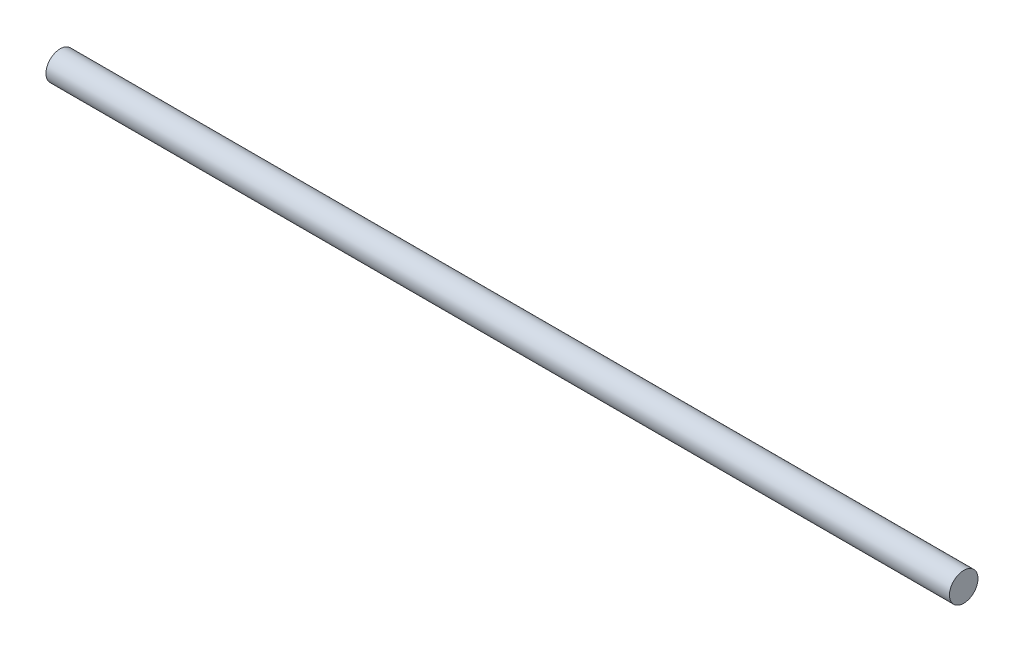
ISO-10303-21;
HEADER;
FILE_DESCRIPTION(('STEP AP214'),'2;1');
FILE_NAME('part.step','',(''),(''),'','','');
FILE_SCHEMA(('AUTOMOTIVE_DESIGN { 1 0 10303 214 1 1 1 1 }'));
ENDSEC;
DATA;
#1=APPLICATION_CONTEXT('core data for automotive mechanical design processes');
#2=APPLICATION_PROTOCOL_DEFINITION('international standard','automotive_design',2000,#1);
#3=PRODUCT_CONTEXT('',#1,'mechanical');
#4=PRODUCT('Part','Part','',(#3));
#5=PRODUCT_RELATED_PRODUCT_CATEGORY('part','',(#4));
#6=PRODUCT_DEFINITION_FORMATION('','',#4);
#7=PRODUCT_DEFINITION_CONTEXT('part definition',#1,'design');
#8=PRODUCT_DEFINITION('design','',#6,#7);
#9=PRODUCT_DEFINITION_SHAPE('','',#8);
#10=(LENGTH_UNIT() NAMED_UNIT(*) SI_UNIT(.MILLI.,.METRE.));
#11=(NAMED_UNIT(*) PLANE_ANGLE_UNIT() SI_UNIT($,.RADIAN.));
#12=(NAMED_UNIT(*) SI_UNIT($,.STERADIAN.) SOLID_ANGLE_UNIT());
#13=UNCERTAINTY_MEASURE_WITH_UNIT(LENGTH_MEASURE(1.E-05),#10,'distance_accuracy_value','');
#14=(GEOMETRIC_REPRESENTATION_CONTEXT(3) GLOBAL_UNCERTAINTY_ASSIGNED_CONTEXT((#13)) GLOBAL_UNIT_ASSIGNED_CONTEXT((#10,
#11,#12)) REPRESENTATION_CONTEXT('',''));
#15=CARTESIAN_POINT('',(0.,0.,0.));
#16=DIRECTION('',(0.,0.,1.));
#17=DIRECTION('',(1.,0.,0.));
#18=AXIS2_PLACEMENT_3D('',#15,#16,#17);
#19=CARTESIAN_POINT('',(190.,0.,0.));
#20=DIRECTION('',(-1.,0.,0.));
#21=DIRECTION('',(0.,0.,1.));
#22=AXIS2_PLACEMENT_3D('',#19,#20,#21);
#23=CYLINDRICAL_SURFACE('',#22,3.);
#24=CARTESIAN_POINT('',(190.,0.,0.));
#25=DIRECTION('',(1.,0.,0.));
#26=DIRECTION('',(0.,0.,-1.));
#27=AXIS2_PLACEMENT_3D('',#24,#25,#26);
#28=CIRCLE('',#27,3.);
#29=CARTESIAN_POINT('',(190.,0.,-3.));
#30=VERTEX_POINT('',#29);
#31=EDGE_CURVE('E10',#30,#30,#28,.T.);
#32=ORIENTED_EDGE('',*,*,#31,.F.);
#33=EDGE_LOOP('',(#32));
#34=FACE_BOUND('',#33,.T.);
#35=CARTESIAN_POINT('',(0.,0.,0.));
#36=DIRECTION('',(1.,0.,0.));
#37=DIRECTION('',(0.,0.,-1.));
#38=AXIS2_PLACEMENT_3D('',#35,#36,#37);
#39=CIRCLE('',#38,3.);
#40=CARTESIAN_POINT('',(0.,0.,-3.));
#41=VERTEX_POINT('',#40);
#42=EDGE_CURVE('E44',#41,#41,#39,.T.);
#43=ORIENTED_EDGE('',*,*,#42,.T.);
#44=EDGE_LOOP('',(#43));
#45=FACE_BOUND('',#44,.T.);
#46=ADVANCED_FACE('F41',(#34,#45),#23,.T.);
#47=CARTESIAN_POINT('',(190.,0.,0.));
#48=DIRECTION('',(1.,0.,0.));
#49=DIRECTION('',(0.,0.,-1.));
#50=AXIS2_PLACEMENT_3D('',#47,#48,#49);
#51=PLANE('',#50);
#52=ORIENTED_EDGE('',*,*,#31,.T.);
#53=EDGE_LOOP('',(#52));
#54=FACE_BOUND('',#53,.T.);
#55=ADVANCED_FACE('F58',(#54),#51,.T.);
#56=CARTESIAN_POINT('',(0.,0.,0.));
#57=DIRECTION('',(1.,0.,0.));
#58=DIRECTION('',(0.,0.,-1.));
#59=AXIS2_PLACEMENT_3D('',#56,#57,#58);
#60=PLANE('',#59);
#61=ORIENTED_EDGE('',*,*,#42,.F.);
#62=EDGE_LOOP('',(#61));
#63=FACE_BOUND('',#62,.T.);
#64=ADVANCED_FACE('F56',(#63),#60,.F.);
#65=CLOSED_SHELL('',(#46,#55,#64));
#66=MANIFOLD_SOLID_BREP('B2',#65);
#67=ADVANCED_BREP_SHAPE_REPRESENTATION('',(#18,#66),#14);
#68=SHAPE_DEFINITION_REPRESENTATION(#9,#67);
ENDSEC;
END-ISO-10303-21;
